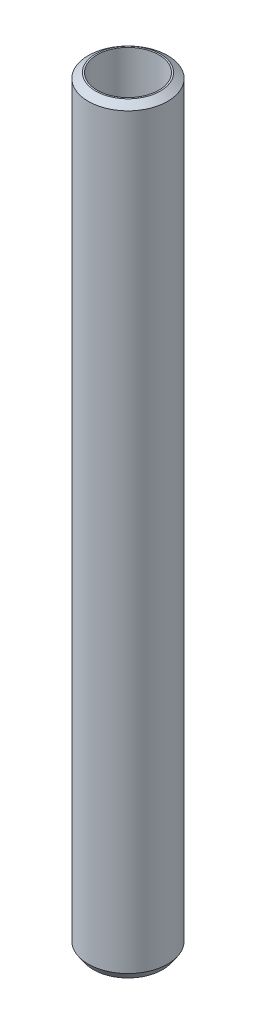
ISO-10303-21;
HEADER;
FILE_DESCRIPTION(('STEP AP214'),'2;1');
FILE_NAME('part.step','',(''),(''),'','','');
FILE_SCHEMA(('AUTOMOTIVE_DESIGN { 1 0 10303 214 1 1 1 1 }'));
ENDSEC;
DATA;
#1=APPLICATION_CONTEXT('core data for automotive mechanical design processes');
#2=APPLICATION_PROTOCOL_DEFINITION('international standard','automotive_design',2000,#1);
#3=PRODUCT_CONTEXT('',#1,'mechanical');
#4=PRODUCT('Part','Part','',(#3));
#5=PRODUCT_RELATED_PRODUCT_CATEGORY('part','',(#4));
#6=PRODUCT_DEFINITION_FORMATION('','',#4);
#7=PRODUCT_DEFINITION_CONTEXT('part definition',#1,'design');
#8=PRODUCT_DEFINITION('design','',#6,#7);
#9=PRODUCT_DEFINITION_SHAPE('','',#8);
#10=(LENGTH_UNIT() NAMED_UNIT(*) SI_UNIT(.MILLI.,.METRE.));
#11=(NAMED_UNIT(*) PLANE_ANGLE_UNIT() SI_UNIT($,.RADIAN.));
#12=(NAMED_UNIT(*) SI_UNIT($,.STERADIAN.) SOLID_ANGLE_UNIT());
#13=UNCERTAINTY_MEASURE_WITH_UNIT(LENGTH_MEASURE(1.E-05),#10,'distance_accuracy_value','');
#14=(GEOMETRIC_REPRESENTATION_CONTEXT(3) GLOBAL_UNCERTAINTY_ASSIGNED_CONTEXT((#13)) GLOBAL_UNIT_ASSIGNED_CONTEXT((#10,
#11,#12)) REPRESENTATION_CONTEXT('',''));
#15=CARTESIAN_POINT('',(0.,0.,0.));
#16=DIRECTION('',(0.,0.,1.));
#17=DIRECTION('',(1.,0.,0.));
#18=AXIS2_PLACEMENT_3D('',#15,#16,#17);
#19=CARTESIAN_POINT('',(0.,573.796063694842,0.));
#20=DIRECTION('',(0.,-1.,0.));
#21=DIRECTION('',(0.,0.,-1.));
#22=AXIS2_PLACEMENT_3D('',#19,#20,#21);
#23=CYLINDRICAL_SURFACE('',#22,30.);
#24=CARTESIAN_POINT('',(0.,569.912078387655,0.));
#25=DIRECTION('',(0.,1.,0.));
#26=DIRECTION('',(0.,0.,1.));
#27=AXIS2_PLACEMENT_3D('',#24,#25,#26);
#28=CIRCLE('',#27,30.);
#29=CARTESIAN_POINT('',(0.,569.912078387655,30.));
#30=VERTEX_POINT('',#29);
#31=EDGE_CURVE('E50',#30,#30,#28,.F.);
#32=ORIENTED_EDGE('',*,*,#31,.T.);
#33=EDGE_LOOP('',(#32));
#34=FACE_BOUND('',#33,.T.);
#35=CARTESIAN_POINT('',(0.,5.6275731657971,0.));
#36=DIRECTION('',(0.,1.,0.));
#37=DIRECTION('',(0.,0.,1.));
#38=AXIS2_PLACEMENT_3D('',#35,#36,#37);
#39=CIRCLE('',#38,30.);
#40=CARTESIAN_POINT('',(0.,5.6275731657971,30.));
#41=VERTEX_POINT('',#40);
#42=EDGE_CURVE('E51',#41,#41,#39,.T.);
#43=ORIENTED_EDGE('',*,*,#42,.T.);
#44=EDGE_LOOP('',(#43));
#45=FACE_BOUND('',#44,.T.);
#46=ADVANCED_FACE('F39',(#34,#45),#23,.T.);
#47=CARTESIAN_POINT('',(0.,573.796063694842,0.));
#48=DIRECTION('',(0.,1.,0.));
#49=DIRECTION('',(0.,0.,1.));
#50=AXIS2_PLACEMENT_3D('',#47,#48,#49);
#51=PLANE('',#50);
#52=CARTESIAN_POINT('',(0.,573.796063694842,0.));
#53=DIRECTION('',(0.,1.,0.));
#54=DIRECTION('',(0.,0.,1.));
#55=AXIS2_PLACEMENT_3D('',#52,#53,#54);
#56=CIRCLE('',#55,24.3724268342024);
#57=CARTESIAN_POINT('',(0.,573.796063694842,24.3724268342024));
#58=VERTEX_POINT('',#57);
#59=EDGE_CURVE('E54',#58,#58,#56,.T.);
#60=ORIENTED_EDGE('',*,*,#59,.T.);
#61=EDGE_LOOP('',(#60));
#62=FACE_BOUND('',#61,.T.);
#63=CARTESIAN_POINT('',(0.,573.796063694842,0.));
#64=DIRECTION('',(0.,1.,0.));
#65=DIRECTION('',(0.,0.,1.));
#66=AXIS2_PLACEMENT_3D('',#63,#64,#65);
#67=CIRCLE('',#66,23.2500510831125);
#68=CARTESIAN_POINT('',(0.,573.796063694842,23.2500510831125));
#69=VERTEX_POINT('',#68);
#70=EDGE_CURVE('E58',#69,#69,#67,.T.);
#71=ORIENTED_EDGE('',*,*,#70,.F.);
#72=EDGE_LOOP('',(#71));
#73=FACE_BOUND('',#72,.T.);
#74=ADVANCED_FACE('F69',(#62,#73),#51,.T.);
#75=CARTESIAN_POINT('',(0.,0.,0.));
#76=DIRECTION('',(0.,1.,0.));
#77=DIRECTION('',(0.,0.,1.));
#78=AXIS2_PLACEMENT_3D('',#75,#76,#77);
#79=PLANE('',#78);
#80=CARTESIAN_POINT('',(0.,0.,0.));
#81=DIRECTION('',(0.,1.,0.));
#82=DIRECTION('',(0.,0.,1.));
#83=AXIS2_PLACEMENT_3D('',#80,#81,#82);
#84=CIRCLE('',#83,26.1160146928142);
#85=CARTESIAN_POINT('',(0.,0.,26.1160146928142));
#86=VERTEX_POINT('',#85);
#87=EDGE_CURVE('E10',#86,#86,#84,.F.);
#88=ORIENTED_EDGE('',*,*,#87,.T.);
#89=EDGE_LOOP('',(#88));
#90=FACE_BOUND('',#89,.T.);
#91=CARTESIAN_POINT('',(0.,0.,0.));
#92=DIRECTION('',(0.,1.,0.));
#93=DIRECTION('',(0.,0.,1.));
#94=AXIS2_PLACEMENT_3D('',#91,#92,#93);
#95=CIRCLE('',#94,23.2500510831125);
#96=CARTESIAN_POINT('',(0.,0.,23.2500510831125));
#97=VERTEX_POINT('',#96);
#98=EDGE_CURVE('E63',#97,#97,#95,.T.);
#99=ORIENTED_EDGE('',*,*,#98,.T.);
#100=EDGE_LOOP('',(#99));
#101=FACE_BOUND('',#100,.T.);
#102=ADVANCED_FACE('F75',(#90,#101),#79,.F.);
#103=CARTESIAN_POINT('',(0.,573.796063694842,0.));
#104=DIRECTION('',(0.,-1.,0.));
#105=DIRECTION('',(0.,0.,-1.));
#106=AXIS2_PLACEMENT_3D('',#103,#104,#105);
#107=CYLINDRICAL_SURFACE('',#106,23.2500510831125);
#108=ORIENTED_EDGE('',*,*,#70,.T.);
#109=EDGE_LOOP('',(#108));
#110=FACE_BOUND('',#109,.T.);
#111=ORIENTED_EDGE('',*,*,#98,.F.);
#112=EDGE_LOOP('',(#111));
#113=FACE_BOUND('',#112,.T.);
#114=ADVANCED_FACE('F70',(#110,#113),#107,.F.);
#115=CARTESIAN_POINT('',(0.,573.796063694842,0.));
#116=DIRECTION('',(0.,-1.,0.));
#117=DIRECTION('',(0.,0.,-1.));
#118=AXIS2_PLACEMENT_3D('',#115,#116,#117);
#119=CONICAL_SURFACE('',#118,24.3724268342024,0.966697811963992);
#120=ORIENTED_EDGE('',*,*,#31,.F.);
#121=EDGE_LOOP('',(#120));
#122=FACE_BOUND('',#121,.T.);
#123=ORIENTED_EDGE('',*,*,#59,.F.);
#124=EDGE_LOOP('',(#123));
#125=FACE_BOUND('',#124,.T.);
#126=ADVANCED_FACE('F81',(#122,#125),#119,.T.);
#127=CARTESIAN_POINT('',(0.,5.6275731657971,0.));
#128=DIRECTION('',(0.,1.,0.));
#129=DIRECTION('',(0.,0.,1.));
#130=AXIS2_PLACEMENT_3D('',#127,#128,#129);
#131=CONICAL_SURFACE('',#130,30.,0.604098514830912);
#132=ORIENTED_EDGE('',*,*,#87,.F.);
#133=EDGE_LOOP('',(#132));
#134=FACE_BOUND('',#133,.T.);
#135=ORIENTED_EDGE('',*,*,#42,.F.);
#136=EDGE_LOOP('',(#135));
#137=FACE_BOUND('',#136,.T.);
#138=ADVANCED_FACE('F45',(#134,#137),#131,.T.);
#139=CLOSED_SHELL('',(#46,#74,#102,#114,#126,#138));
#140=MANIFOLD_SOLID_BREP('B2',#139);
#141=ADVANCED_BREP_SHAPE_REPRESENTATION('',(#18,#140),#14);
#142=SHAPE_DEFINITION_REPRESENTATION(#9,#141);
ENDSEC;
END-ISO-10303-21;
